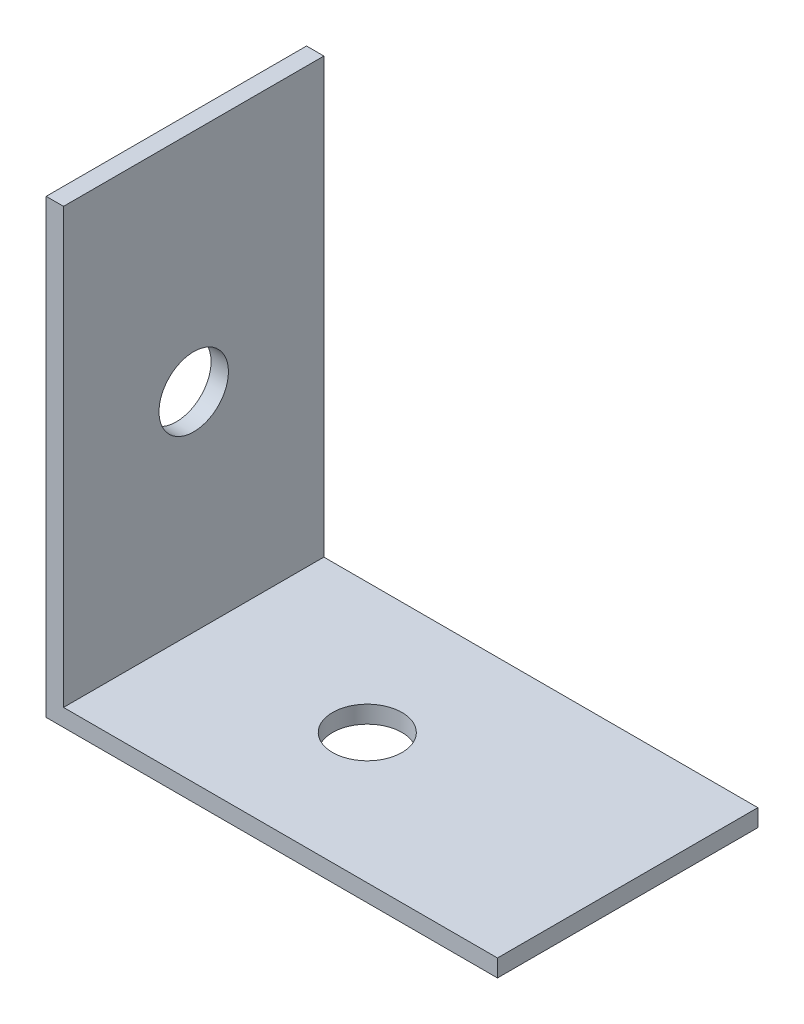
ISO-10303-21;
HEADER;
FILE_DESCRIPTION(('STEP AP214'),'2;1');
FILE_NAME('part.step','',(''),(''),'','','');
FILE_SCHEMA(('AUTOMOTIVE_DESIGN { 1 0 10303 214 1 1 1 1 }'));
ENDSEC;
DATA;
#1=APPLICATION_CONTEXT('core data for automotive mechanical design processes');
#2=APPLICATION_PROTOCOL_DEFINITION('international standard','automotive_design',2000,#1);
#3=PRODUCT_CONTEXT('',#1,'mechanical');
#4=PRODUCT('Part','Part','',(#3));
#5=PRODUCT_RELATED_PRODUCT_CATEGORY('part','',(#4));
#6=PRODUCT_DEFINITION_FORMATION('','',#4);
#7=PRODUCT_DEFINITION_CONTEXT('part definition',#1,'design');
#8=PRODUCT_DEFINITION('design','',#6,#7);
#9=PRODUCT_DEFINITION_SHAPE('','',#8);
#10=(LENGTH_UNIT() NAMED_UNIT(*) SI_UNIT(.MILLI.,.METRE.));
#11=(NAMED_UNIT(*) PLANE_ANGLE_UNIT() SI_UNIT($,.RADIAN.));
#12=(NAMED_UNIT(*) SI_UNIT($,.STERADIAN.) SOLID_ANGLE_UNIT());
#13=UNCERTAINTY_MEASURE_WITH_UNIT(LENGTH_MEASURE(1.E-05),#10,'distance_accuracy_value','');
#14=(GEOMETRIC_REPRESENTATION_CONTEXT(3) GLOBAL_UNCERTAINTY_ASSIGNED_CONTEXT((#13)) GLOBAL_UNIT_ASSIGNED_CONTEXT((#10,
#11,#12)) REPRESENTATION_CONTEXT('',''));
#15=CARTESIAN_POINT('',(0.,0.,0.));
#16=DIRECTION('',(0.,0.,1.));
#17=DIRECTION('',(1.,0.,0.));
#18=AXIS2_PLACEMENT_3D('',#15,#16,#17);
#19=CARTESIAN_POINT('',(0.,0.,15.));
#20=DIRECTION('',(-1.,0.,0.));
#21=DIRECTION('',(0.,0.,1.));
#22=AXIS2_PLACEMENT_3D('',#19,#20,#21);
#23=PLANE('',#22);
#24=CARTESIAN_POINT('',(0.,12.,7.5));
#25=DIRECTION('',(1.,0.,0.));
#26=DIRECTION('',(0.,0.,-1.));
#27=AXIS2_PLACEMENT_3D('',#24,#25,#26);
#28=CIRCLE('',#27,2.);
#29=CARTESIAN_POINT('',(0.,12.,5.5));
#30=VERTEX_POINT('',#29);
#31=EDGE_CURVE('E164',#30,#30,#28,.T.);
#32=ORIENTED_EDGE('',*,*,#31,.F.);
#33=EDGE_LOOP('',(#32));
#34=FACE_BOUND('',#33,.T.);
#35=DIRECTION('',(0.,1.,0.));
#36=VECTOR('',#35,1.);
#37=CARTESIAN_POINT('',(0.,0.,0.));
#38=LINE('',#37,#36);
#39=CARTESIAN_POINT('',(0.,0.,0.));
#40=VERTEX_POINT('',#39);
#41=CARTESIAN_POINT('',(0.,25.,0.));
#42=VERTEX_POINT('',#41);
#43=EDGE_CURVE('E118',#40,#42,#38,.T.);
#44=ORIENTED_EDGE('',*,*,#43,.T.);
#45=DIRECTION('',(0.,0.,-1.));
#46=VECTOR('',#45,1.);
#47=CARTESIAN_POINT('',(0.,25.,15.));
#48=LINE('',#47,#46);
#49=CARTESIAN_POINT('',(0.,25.,15.));
#50=VERTEX_POINT('',#49);
#51=EDGE_CURVE('E11',#50,#42,#48,.T.);
#52=ORIENTED_EDGE('',*,*,#51,.F.);
#53=DIRECTION('',(0.,1.,0.));
#54=VECTOR('',#53,1.);
#55=CARTESIAN_POINT('',(0.,0.,15.));
#56=LINE('',#55,#54);
#57=CARTESIAN_POINT('',(0.,0.,15.));
#58=VERTEX_POINT('',#57);
#59=EDGE_CURVE('E128',#58,#50,#56,.T.);
#60=ORIENTED_EDGE('',*,*,#59,.F.);
#61=DIRECTION('',(0.,0.,-1.));
#62=VECTOR('',#61,1.);
#63=CARTESIAN_POINT('',(0.,0.,15.));
#64=LINE('',#63,#62);
#65=EDGE_CURVE('E114',#58,#40,#64,.T.);
#66=ORIENTED_EDGE('',*,*,#65,.T.);
#67=EDGE_LOOP('',(#44,#52,#60,#66));
#68=FACE_BOUND('',#67,.T.);
#69=ADVANCED_FACE('F33',(#34,#68),#23,.F.);
#70=CARTESIAN_POINT('',(0.,25.,15.));
#71=DIRECTION('',(0.,-1.,0.));
#72=DIRECTION('',(0.,0.,-1.));
#73=AXIS2_PLACEMENT_3D('',#70,#71,#72);
#74=PLANE('',#73);
#75=DIRECTION('',(-1.,0.,0.));
#76=VECTOR('',#75,1.);
#77=CARTESIAN_POINT('',(0.,25.,0.));
#78=LINE('',#77,#76);
#79=CARTESIAN_POINT('',(-1.,25.,0.));
#80=VERTEX_POINT('',#79);
#81=EDGE_CURVE('E121',#42,#80,#78,.T.);
#82=ORIENTED_EDGE('',*,*,#81,.T.);
#83=DIRECTION('',(0.,0.,-1.));
#84=VECTOR('',#83,1.);
#85=CARTESIAN_POINT('',(-1.,25.,15.));
#86=LINE('',#85,#84);
#87=CARTESIAN_POINT('',(-1.,25.,15.));
#88=VERTEX_POINT('',#87);
#89=EDGE_CURVE('E42',#88,#80,#86,.T.);
#90=ORIENTED_EDGE('',*,*,#89,.F.);
#91=DIRECTION('',(-1.,0.,0.));
#92=VECTOR('',#91,1.);
#93=CARTESIAN_POINT('',(0.,25.,15.));
#94=LINE('',#93,#92);
#95=EDGE_CURVE('E87',#50,#88,#94,.T.);
#96=ORIENTED_EDGE('',*,*,#95,.F.);
#97=ORIENTED_EDGE('',*,*,#51,.T.);
#98=EDGE_LOOP('',(#82,#90,#96,#97));
#99=FACE_BOUND('',#98,.T.);
#100=ADVANCED_FACE('F157',(#99),#74,.F.);
#101=CARTESIAN_POINT('',(-1.,-1.,15.));
#102=DIRECTION('',(1.,0.,0.));
#103=DIRECTION('',(0.,0.,-1.));
#104=AXIS2_PLACEMENT_3D('',#101,#102,#103);
#105=PLANE('',#104);
#106=CARTESIAN_POINT('',(-1.,12.,7.5));
#107=DIRECTION('',(1.,0.,0.));
#108=DIRECTION('',(0.,0.,-1.));
#109=AXIS2_PLACEMENT_3D('',#106,#107,#108);
#110=CIRCLE('',#109,2.);
#111=CARTESIAN_POINT('',(-1.,12.,5.5));
#112=VERTEX_POINT('',#111);
#113=EDGE_CURVE('E36',#112,#112,#110,.T.);
#114=ORIENTED_EDGE('',*,*,#113,.T.);
#115=EDGE_LOOP('',(#114));
#116=FACE_BOUND('',#115,.T.);
#117=DIRECTION('',(0.,-1.,0.));
#118=VECTOR('',#117,1.);
#119=CARTESIAN_POINT('',(-1.,-1.,0.));
#120=LINE('',#119,#118);
#121=CARTESIAN_POINT('',(-1.,-1.,0.));
#122=VERTEX_POINT('',#121);
#123=EDGE_CURVE('E123',#80,#122,#120,.T.);
#124=ORIENTED_EDGE('',*,*,#123,.T.);
#125=DIRECTION('',(0.,0.,-1.));
#126=VECTOR('',#125,1.);
#127=CARTESIAN_POINT('',(-1.,-1.,15.));
#128=LINE('',#127,#126);
#129=CARTESIAN_POINT('',(-1.,-1.,15.));
#130=VERTEX_POINT('',#129);
#131=EDGE_CURVE('E109',#130,#122,#128,.T.);
#132=ORIENTED_EDGE('',*,*,#131,.F.);
#133=DIRECTION('',(0.,-1.,0.));
#134=VECTOR('',#133,1.);
#135=CARTESIAN_POINT('',(-1.,-1.,15.));
#136=LINE('',#135,#134);
#137=EDGE_CURVE('E100',#88,#130,#136,.T.);
#138=ORIENTED_EDGE('',*,*,#137,.F.);
#139=ORIENTED_EDGE('',*,*,#89,.T.);
#140=EDGE_LOOP('',(#124,#132,#138,#139));
#141=FACE_BOUND('',#140,.T.);
#142=ADVANCED_FACE('F135',(#116,#141),#105,.F.);
#143=CARTESIAN_POINT('',(-1.,-1.,15.));
#144=DIRECTION('',(0.,1.,0.));
#145=DIRECTION('',(0.,0.,1.));
#146=AXIS2_PLACEMENT_3D('',#143,#144,#145);
#147=PLANE('',#146);
#148=CARTESIAN_POINT('',(10.,-0.999999999999999,7.5));
#149=DIRECTION('',(0.,1.,0.));
#150=DIRECTION('',(0.,0.,1.));
#151=AXIS2_PLACEMENT_3D('',#148,#149,#150);
#152=CIRCLE('',#151,2.);
#153=CARTESIAN_POINT('',(10.,-0.999999999999999,9.5));
#154=VERTEX_POINT('',#153);
#155=EDGE_CURVE('E166',#154,#154,#152,.T.);
#156=ORIENTED_EDGE('',*,*,#155,.T.);
#157=EDGE_LOOP('',(#156));
#158=FACE_BOUND('',#157,.T.);
#159=DIRECTION('',(1.,0.,0.));
#160=VECTOR('',#159,1.);
#161=CARTESIAN_POINT('',(-1.,-1.,0.));
#162=LINE('',#161,#160);
#163=CARTESIAN_POINT('',(25.,-1.,0.));
#164=VERTEX_POINT('',#163);
#165=EDGE_CURVE('E108',#122,#164,#162,.T.);
#166=ORIENTED_EDGE('',*,*,#165,.T.);
#167=DIRECTION('',(0.,0.,-1.));
#168=VECTOR('',#167,1.);
#169=CARTESIAN_POINT('',(25.,-1.,15.));
#170=LINE('',#169,#168);
#171=CARTESIAN_POINT('',(25.,-1.,15.));
#172=VERTEX_POINT('',#171);
#173=EDGE_CURVE('E105',#172,#164,#170,.T.);
#174=ORIENTED_EDGE('',*,*,#173,.F.);
#175=DIRECTION('',(1.,0.,0.));
#176=VECTOR('',#175,1.);
#177=CARTESIAN_POINT('',(-1.,-1.,15.));
#178=LINE('',#177,#176);
#179=EDGE_CURVE('E94',#130,#172,#178,.T.);
#180=ORIENTED_EDGE('',*,*,#179,.F.);
#181=ORIENTED_EDGE('',*,*,#131,.T.);
#182=EDGE_LOOP('',(#166,#174,#180,#181));
#183=FACE_BOUND('',#182,.T.);
#184=ADVANCED_FACE('F106',(#158,#183),#147,.F.);
#185=CARTESIAN_POINT('',(25.,0.,15.));
#186=DIRECTION('',(-1.,0.,0.));
#187=DIRECTION('',(0.,0.,1.));
#188=AXIS2_PLACEMENT_3D('',#185,#186,#187);
#189=PLANE('',#188);
#190=DIRECTION('',(0.,1.,0.));
#191=VECTOR('',#190,1.);
#192=CARTESIAN_POINT('',(25.,0.,0.));
#193=LINE('',#192,#191);
#194=CARTESIAN_POINT('',(25.,0.,0.));
#195=VERTEX_POINT('',#194);
#196=EDGE_CURVE('E73',#164,#195,#193,.T.);
#197=ORIENTED_EDGE('',*,*,#196,.T.);
#198=DIRECTION('',(0.,0.,-1.));
#199=VECTOR('',#198,1.);
#200=CARTESIAN_POINT('',(25.,0.,15.));
#201=LINE('',#200,#199);
#202=CARTESIAN_POINT('',(25.,0.,15.));
#203=VERTEX_POINT('',#202);
#204=EDGE_CURVE('E110',#203,#195,#201,.T.);
#205=ORIENTED_EDGE('',*,*,#204,.F.);
#206=DIRECTION('',(0.,1.,0.));
#207=VECTOR('',#206,1.);
#208=CARTESIAN_POINT('',(25.,0.,15.));
#209=LINE('',#208,#207);
#210=EDGE_CURVE('E98',#172,#203,#209,.T.);
#211=ORIENTED_EDGE('',*,*,#210,.F.);
#212=ORIENTED_EDGE('',*,*,#173,.T.);
#213=EDGE_LOOP('',(#197,#205,#211,#212));
#214=FACE_BOUND('',#213,.T.);
#215=ADVANCED_FACE('F112',(#214),#189,.F.);
#216=CARTESIAN_POINT('',(0.,0.,15.));
#217=DIRECTION('',(0.,-1.,0.));
#218=DIRECTION('',(0.,0.,-1.));
#219=AXIS2_PLACEMENT_3D('',#216,#217,#218);
#220=PLANE('',#219);
#221=CARTESIAN_POINT('',(10.,0.,7.5));
#222=DIRECTION('',(0.,1.,0.));
#223=DIRECTION('',(0.,0.,1.));
#224=AXIS2_PLACEMENT_3D('',#221,#222,#223);
#225=CIRCLE('',#224,2.);
#226=CARTESIAN_POINT('',(10.,0.,9.5));
#227=VERTEX_POINT('',#226);
#228=EDGE_CURVE('E170',#227,#227,#225,.T.);
#229=ORIENTED_EDGE('',*,*,#228,.F.);
#230=EDGE_LOOP('',(#229));
#231=FACE_BOUND('',#230,.T.);
#232=DIRECTION('',(-1.,0.,0.));
#233=VECTOR('',#232,1.);
#234=CARTESIAN_POINT('',(0.,0.,0.));
#235=LINE('',#234,#233);
#236=EDGE_CURVE('E79',#195,#40,#235,.T.);
#237=ORIENTED_EDGE('',*,*,#236,.T.);
#238=ORIENTED_EDGE('',*,*,#65,.F.);
#239=DIRECTION('',(-1.,0.,0.));
#240=VECTOR('',#239,1.);
#241=CARTESIAN_POINT('',(0.,0.,15.));
#242=LINE('',#241,#240);
#243=EDGE_CURVE('E50',#203,#58,#242,.T.);
#244=ORIENTED_EDGE('',*,*,#243,.F.);
#245=ORIENTED_EDGE('',*,*,#204,.T.);
#246=EDGE_LOOP('',(#237,#238,#244,#245));
#247=FACE_BOUND('',#246,.T.);
#248=ADVANCED_FACE('F142',(#231,#247),#220,.F.);
#249=CARTESIAN_POINT('',(0.,0.,15.));
#250=DIRECTION('',(0.,0.,1.));
#251=DIRECTION('',(1.,0.,0.));
#252=AXIS2_PLACEMENT_3D('',#249,#250,#251);
#253=PLANE('',#252);
#254=ORIENTED_EDGE('',*,*,#59,.T.);
#255=ORIENTED_EDGE('',*,*,#95,.T.);
#256=ORIENTED_EDGE('',*,*,#137,.T.);
#257=ORIENTED_EDGE('',*,*,#179,.T.);
#258=ORIENTED_EDGE('',*,*,#210,.T.);
#259=ORIENTED_EDGE('',*,*,#243,.T.);
#260=EDGE_LOOP('',(#254,#255,#256,#257,#258,#259));
#261=FACE_BOUND('',#260,.T.);
#262=ADVANCED_FACE('F96',(#261),#253,.T.);
#263=CARTESIAN_POINT('',(0.,0.,0.));
#264=DIRECTION('',(0.,0.,1.));
#265=DIRECTION('',(1.,0.,0.));
#266=AXIS2_PLACEMENT_3D('',#263,#264,#265);
#267=PLANE('',#266);
#268=ORIENTED_EDGE('',*,*,#43,.F.);
#269=ORIENTED_EDGE('',*,*,#236,.F.);
#270=ORIENTED_EDGE('',*,*,#196,.F.);
#271=ORIENTED_EDGE('',*,*,#165,.F.);
#272=ORIENTED_EDGE('',*,*,#123,.F.);
#273=ORIENTED_EDGE('',*,*,#81,.F.);
#274=EDGE_LOOP('',(#268,#269,#270,#271,#272,#273));
#275=FACE_BOUND('',#274,.T.);
#276=ADVANCED_FACE('F138',(#275),#267,.F.);
#277=CARTESIAN_POINT('',(-15.,12.,7.5));
#278=DIRECTION('',(1.,0.,0.));
#279=DIRECTION('',(0.,0.,-1.));
#280=AXIS2_PLACEMENT_3D('',#277,#278,#279);
#281=CYLINDRICAL_SURFACE('',#280,2.);
#282=ORIENTED_EDGE('',*,*,#31,.T.);
#283=EDGE_LOOP('',(#282));
#284=FACE_BOUND('',#283,.T.);
#285=ORIENTED_EDGE('',*,*,#113,.F.);
#286=EDGE_LOOP('',(#285));
#287=FACE_BOUND('',#286,.T.);
#288=ADVANCED_FACE('F180',(#284,#287),#281,.F.);
#289=CARTESIAN_POINT('',(10.,-10.,7.5));
#290=DIRECTION('',(0.,1.,0.));
#291=DIRECTION('',(0.,0.,1.));
#292=AXIS2_PLACEMENT_3D('',#289,#290,#291);
#293=CYLINDRICAL_SURFACE('',#292,2.);
#294=ORIENTED_EDGE('',*,*,#228,.T.);
#295=EDGE_LOOP('',(#294));
#296=FACE_BOUND('',#295,.T.);
#297=ORIENTED_EDGE('',*,*,#155,.F.);
#298=EDGE_LOOP('',(#297));
#299=FACE_BOUND('',#298,.T.);
#300=ADVANCED_FACE('F177',(#296,#299),#293,.F.);
#301=CLOSED_SHELL('',(#69,#100,#142,#184,#215,#248,#262,#276,#288,#300));
#302=MANIFOLD_SOLID_BREP('B2',#301);
#303=ADVANCED_BREP_SHAPE_REPRESENTATION('',(#18,#302),#14);
#304=SHAPE_DEFINITION_REPRESENTATION(#9,#303);
ENDSEC;
END-ISO-10303-21;
